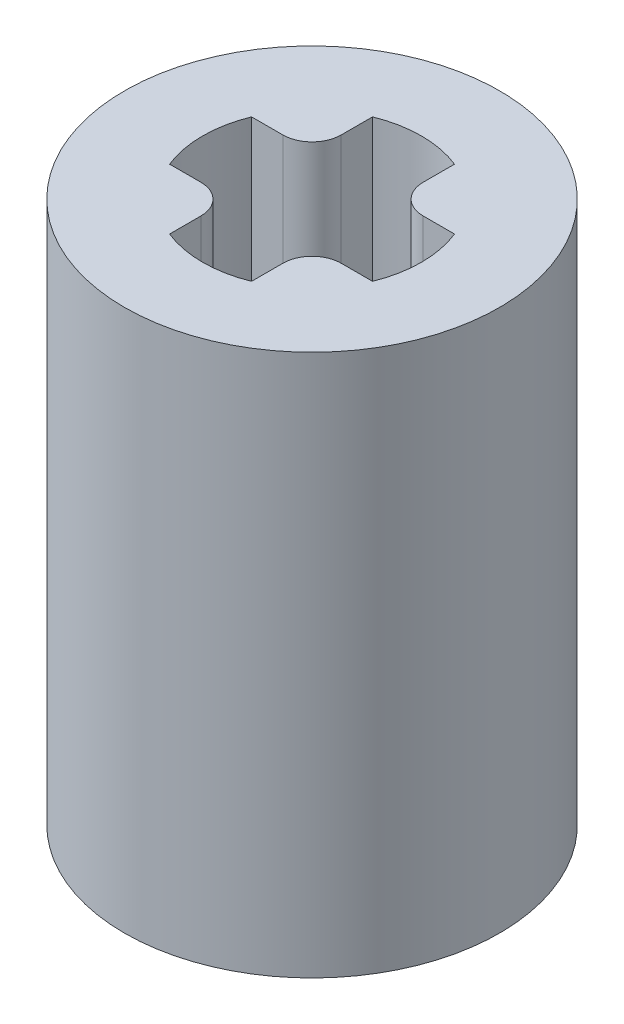
ISO-10303-21;
HEADER;
FILE_DESCRIPTION(('STEP AP214'),'2;1');
FILE_NAME('part.step','',(''),(''),'','','');
FILE_SCHEMA(('AUTOMOTIVE_DESIGN { 1 0 10303 214 1 1 1 1 }'));
ENDSEC;
DATA;
#1=APPLICATION_CONTEXT('core data for automotive mechanical design processes');
#2=APPLICATION_PROTOCOL_DEFINITION('international standard','automotive_design',2000,#1);
#3=PRODUCT_CONTEXT('',#1,'mechanical');
#4=PRODUCT('Part','Part','',(#3));
#5=PRODUCT_RELATED_PRODUCT_CATEGORY('part','',(#4));
#6=PRODUCT_DEFINITION_FORMATION('','',#4);
#7=PRODUCT_DEFINITION_CONTEXT('part definition',#1,'design');
#8=PRODUCT_DEFINITION('design','',#6,#7);
#9=PRODUCT_DEFINITION_SHAPE('','',#8);
#10=(LENGTH_UNIT() NAMED_UNIT(*) SI_UNIT(.MILLI.,.METRE.));
#11=(NAMED_UNIT(*) PLANE_ANGLE_UNIT() SI_UNIT($,.RADIAN.));
#12=(NAMED_UNIT(*) SI_UNIT($,.STERADIAN.) SOLID_ANGLE_UNIT());
#13=UNCERTAINTY_MEASURE_WITH_UNIT(LENGTH_MEASURE(1.E-05),#10,'distance_accuracy_value','');
#14=(GEOMETRIC_REPRESENTATION_CONTEXT(3) GLOBAL_UNCERTAINTY_ASSIGNED_CONTEXT((#13)) GLOBAL_UNIT_ASSIGNED_CONTEXT((#10,
#11,#12)) REPRESENTATION_CONTEXT('',''));
#15=CARTESIAN_POINT('',(0.,0.,0.));
#16=DIRECTION('',(0.,0.,1.));
#17=DIRECTION('',(1.,0.,0.));
#18=AXIS2_PLACEMENT_3D('',#15,#16,#17);
#19=CARTESIAN_POINT('',(0.,6.5,0.));
#20=DIRECTION('',(0.,-1.,0.));
#21=DIRECTION('',(0.,0.,-1.));
#22=AXIS2_PLACEMENT_3D('',#19,#20,#21);
#23=CYLINDRICAL_SURFACE('',#22,4.5);
#24=CARTESIAN_POINT('',(0.,6.5,0.));
#25=DIRECTION('',(0.,1.,0.));
#26=DIRECTION('',(0.,0.,1.));
#27=AXIS2_PLACEMENT_3D('',#24,#25,#26);
#28=CIRCLE('',#27,4.5);
#29=CARTESIAN_POINT('',(0.,6.5,4.5));
#30=VERTEX_POINT('',#29);
#31=EDGE_CURVE('E11',#30,#30,#28,.T.);
#32=ORIENTED_EDGE('',*,*,#31,.F.);
#33=EDGE_LOOP('',(#32));
#34=FACE_BOUND('',#33,.T.);
#35=CARTESIAN_POINT('',(0.,-6.5,0.));
#36=DIRECTION('',(0.,1.,0.));
#37=DIRECTION('',(0.,0.,1.));
#38=AXIS2_PLACEMENT_3D('',#35,#36,#37);
#39=CIRCLE('',#38,4.5);
#40=CARTESIAN_POINT('',(0.,-6.5,4.5));
#41=VERTEX_POINT('',#40);
#42=EDGE_CURVE('E37',#41,#41,#39,.T.);
#43=ORIENTED_EDGE('',*,*,#42,.T.);
#44=EDGE_LOOP('',(#43));
#45=FACE_BOUND('',#44,.T.);
#46=ADVANCED_FACE('F34',(#34,#45),#23,.T.);
#47=CARTESIAN_POINT('',(0.,6.5,0.));
#48=DIRECTION('',(0.,1.,0.));
#49=DIRECTION('',(0.,0.,1.));
#50=AXIS2_PLACEMENT_3D('',#47,#48,#49);
#51=PLANE('',#50);
#52=CARTESIAN_POINT('',(0.,6.5,0.));
#53=DIRECTION('',(0.,1.,0.));
#54=DIRECTION('',(0.,0.,1.));
#55=AXIS2_PLACEMENT_3D('',#52,#53,#54);
#56=CIRCLE('',#55,2.625);
#57=CARTESIAN_POINT('',(0.983,6.5,-2.4339958915331));
#58=VERTEX_POINT('',#57);
#59=CARTESIAN_POINT('',(-0.983,6.5,-2.4339958915331));
#60=VERTEX_POINT('',#59);
#61=EDGE_CURVE('E48',#58,#60,#56,.T.);
#62=ORIENTED_EDGE('',*,*,#61,.F.);
#63=DIRECTION('',(0.,0.,-1.));
#64=VECTOR('',#63,1.);
#65=CARTESIAN_POINT('',(0.983,6.5,-2.4339958915331));
#66=LINE('',#65,#64);
#67=CARTESIAN_POINT('',(0.983000000000003,6.5,-1.683));
#68=VERTEX_POINT('',#67);
#69=EDGE_CURVE('E191',#68,#58,#66,.T.);
#70=ORIENTED_EDGE('',*,*,#69,.F.);
#71=CARTESIAN_POINT('',(1.683,6.5,-1.683));
#72=DIRECTION('',(0.,-1.,0.));
#73=DIRECTION('',(0.,0.,1.));
#74=AXIS2_PLACEMENT_3D('',#71,#72,#73);
#75=CIRCLE('',#74,0.7);
#76=CARTESIAN_POINT('',(1.683,6.5,-0.983));
#77=VERTEX_POINT('',#76);
#78=EDGE_CURVE('E194',#77,#68,#75,.T.);
#79=ORIENTED_EDGE('',*,*,#78,.F.);
#80=DIRECTION('',(-1.,0.,0.));
#81=VECTOR('',#80,1.);
#82=CARTESIAN_POINT('',(1.683,6.5,-0.983));
#83=LINE('',#82,#81);
#84=CARTESIAN_POINT('',(2.4339958915331,6.5,-0.983000000000001));
#85=VERTEX_POINT('',#84);
#86=EDGE_CURVE('E270',#85,#77,#83,.T.);
#87=ORIENTED_EDGE('',*,*,#86,.F.);
#88=CARTESIAN_POINT('',(0.,6.5,0.));
#89=DIRECTION('',(0.,1.,0.));
#90=DIRECTION('',(0.,0.,1.));
#91=AXIS2_PLACEMENT_3D('',#88,#89,#90);
#92=CIRCLE('',#91,2.625);
#93=CARTESIAN_POINT('',(2.4339958915331,6.5,0.983));
#94=VERTEX_POINT('',#93);
#95=EDGE_CURVE('E267',#94,#85,#92,.T.);
#96=ORIENTED_EDGE('',*,*,#95,.F.);
#97=DIRECTION('',(1.,0.,0.));
#98=VECTOR('',#97,1.);
#99=CARTESIAN_POINT('',(1.683,6.5,0.983));
#100=LINE('',#99,#98);
#101=CARTESIAN_POINT('',(1.683,6.5,0.983));
#102=VERTEX_POINT('',#101);
#103=EDGE_CURVE('E264',#102,#94,#100,.T.);
#104=ORIENTED_EDGE('',*,*,#103,.F.);
#105=CARTESIAN_POINT('',(1.683,6.5,1.683));
#106=DIRECTION('',(0.,-1.,0.));
#107=DIRECTION('',(0.,0.,-1.));
#108=AXIS2_PLACEMENT_3D('',#105,#106,#107);
#109=CIRCLE('',#108,0.7);
#110=CARTESIAN_POINT('',(0.983000000000003,6.5,1.683));
#111=VERTEX_POINT('',#110);
#112=EDGE_CURVE('E261',#111,#102,#109,.T.);
#113=ORIENTED_EDGE('',*,*,#112,.F.);
#114=DIRECTION('',(0.,0.,-1.));
#115=VECTOR('',#114,1.);
#116=CARTESIAN_POINT('',(0.983000000000002,6.5,2.4339958915331));
#117=LINE('',#116,#115);
#118=CARTESIAN_POINT('',(0.983000000000002,6.5,2.4339958915331));
#119=VERTEX_POINT('',#118);
#120=EDGE_CURVE('E258',#119,#111,#117,.T.);
#121=ORIENTED_EDGE('',*,*,#120,.F.);
#122=CARTESIAN_POINT('',(0.,6.5,0.));
#123=DIRECTION('',(0.,1.,0.));
#124=DIRECTION('',(0.,0.,1.));
#125=AXIS2_PLACEMENT_3D('',#122,#123,#124);
#126=CIRCLE('',#125,2.625);
#127=CARTESIAN_POINT('',(-0.983000000000001,6.5,2.4339958915331));
#128=VERTEX_POINT('',#127);
#129=EDGE_CURVE('E255',#128,#119,#126,.T.);
#130=ORIENTED_EDGE('',*,*,#129,.F.);
#131=DIRECTION('',(0.,0.,1.));
#132=VECTOR('',#131,1.);
#133=CARTESIAN_POINT('',(-0.983,6.5,2.4339958915331));
#134=LINE('',#133,#132);
#135=CARTESIAN_POINT('',(-0.983000000000002,6.5,1.683));
#136=VERTEX_POINT('',#135);
#137=EDGE_CURVE('E252',#136,#128,#134,.T.);
#138=ORIENTED_EDGE('',*,*,#137,.F.);
#139=CARTESIAN_POINT('',(-1.683,6.5,1.683));
#140=DIRECTION('',(0.,-1.,0.));
#141=DIRECTION('',(0.,0.,1.));
#142=AXIS2_PLACEMENT_3D('',#139,#140,#141);
#143=CIRCLE('',#142,0.7);
#144=CARTESIAN_POINT('',(-1.683,6.5,0.983));
#145=VERTEX_POINT('',#144);
#146=EDGE_CURVE('E249',#145,#136,#143,.T.);
#147=ORIENTED_EDGE('',*,*,#146,.F.);
#148=DIRECTION('',(1.,0.,0.));
#149=VECTOR('',#148,1.);
#150=CARTESIAN_POINT('',(-1.683,6.5,0.983));
#151=LINE('',#150,#149);
#152=CARTESIAN_POINT('',(-2.4339958915331,6.5,0.983000000000001));
#153=VERTEX_POINT('',#152);
#154=EDGE_CURVE('E246',#153,#145,#151,.T.);
#155=ORIENTED_EDGE('',*,*,#154,.F.);
#156=CARTESIAN_POINT('',(0.,6.5,0.));
#157=DIRECTION('',(0.,1.,0.));
#158=DIRECTION('',(0.,0.,1.));
#159=AXIS2_PLACEMENT_3D('',#156,#157,#158);
#160=CIRCLE('',#159,2.625);
#161=CARTESIAN_POINT('',(-2.4339958915331,6.5,-0.983));
#162=VERTEX_POINT('',#161);
#163=EDGE_CURVE('E243',#162,#153,#160,.T.);
#164=ORIENTED_EDGE('',*,*,#163,.F.);
#165=DIRECTION('',(-1.,0.,0.));
#166=VECTOR('',#165,1.);
#167=CARTESIAN_POINT('',(-1.683,6.5,-0.983));
#168=LINE('',#167,#166);
#169=CARTESIAN_POINT('',(-1.683,6.5,-0.983));
#170=VERTEX_POINT('',#169);
#171=EDGE_CURVE('E240',#170,#162,#168,.T.);
#172=ORIENTED_EDGE('',*,*,#171,.F.);
#173=CARTESIAN_POINT('',(-1.683,6.5,-1.683));
#174=DIRECTION('',(0.,-1.,0.));
#175=DIRECTION('',(0.,0.,-1.));
#176=AXIS2_PLACEMENT_3D('',#173,#174,#175);
#177=CIRCLE('',#176,0.7);
#178=CARTESIAN_POINT('',(-0.983000000000002,6.5,-1.683));
#179=VERTEX_POINT('',#178);
#180=EDGE_CURVE('E237',#179,#170,#177,.T.);
#181=ORIENTED_EDGE('',*,*,#180,.F.);
#182=DIRECTION('',(0.,0.,1.));
#183=VECTOR('',#182,1.);
#184=CARTESIAN_POINT('',(-0.983,6.5,-2.4339958915331));
#185=LINE('',#184,#183);
#186=EDGE_CURVE('E235',#60,#179,#185,.T.);
#187=ORIENTED_EDGE('',*,*,#186,.F.);
#188=EDGE_LOOP('',(#62,#70,#79,#87,#96,#104,#113,#121,#130,#138,#147,#155,#164,#172,#181,#187));
#189=FACE_BOUND('',#188,.T.);
#190=ORIENTED_EDGE('',*,*,#31,.T.);
#191=EDGE_LOOP('',(#190));
#192=FACE_BOUND('',#191,.T.);
#193=ADVANCED_FACE('F362',(#189,#192),#51,.T.);
#194=CARTESIAN_POINT('',(0.,-6.5,0.));
#195=DIRECTION('',(0.,1.,0.));
#196=DIRECTION('',(0.,0.,1.));
#197=AXIS2_PLACEMENT_3D('',#194,#195,#196);
#198=PLANE('',#197);
#199=DIRECTION('',(0.,0.,1.));
#200=VECTOR('',#199,1.);
#201=CARTESIAN_POINT('',(1.5865,-6.5,2.11512499630636));
#202=LINE('',#201,#200);
#203=CARTESIAN_POINT('',(1.5865,-6.5,-2.11512499630636));
#204=VERTEX_POINT('',#203);
#205=CARTESIAN_POINT('',(1.5865,-6.5,2.11512499630636));
#206=VERTEX_POINT('',#205);
#207=EDGE_CURVE('E319',#204,#206,#202,.T.);
#208=ORIENTED_EDGE('',*,*,#207,.F.);
#209=CARTESIAN_POINT('',(0.,-6.5,0.));
#210=DIRECTION('',(0.,-1.,0.));
#211=DIRECTION('',(0.,0.,-1.));
#212=AXIS2_PLACEMENT_3D('',#209,#210,#211);
#213=CIRCLE('',#212,2.644);
#214=CARTESIAN_POINT('',(-1.5865,-6.5,-2.11512499630636));
#215=VERTEX_POINT('',#214);
#216=EDGE_CURVE('E56',#215,#204,#213,.T.);
#217=ORIENTED_EDGE('',*,*,#216,.F.);
#218=DIRECTION('',(0.,0.,-1.));
#219=VECTOR('',#218,1.);
#220=CARTESIAN_POINT('',(-1.5865,-6.5,-2.11512499630636));
#221=LINE('',#220,#219);
#222=CARTESIAN_POINT('',(-1.5865,-6.5,2.11512499630636));
#223=VERTEX_POINT('',#222);
#224=EDGE_CURVE('E308',#223,#215,#221,.T.);
#225=ORIENTED_EDGE('',*,*,#224,.F.);
#226=CARTESIAN_POINT('',(0.,-6.5,0.));
#227=DIRECTION('',(0.,-1.,0.));
#228=DIRECTION('',(0.,0.,-1.));
#229=AXIS2_PLACEMENT_3D('',#226,#227,#228);
#230=CIRCLE('',#229,2.644);
#231=EDGE_CURVE('E322',#206,#223,#230,.T.);
#232=ORIENTED_EDGE('',*,*,#231,.F.);
#233=EDGE_LOOP('',(#208,#217,#225,#232));
#234=FACE_BOUND('',#233,.T.);
#235=ORIENTED_EDGE('',*,*,#42,.F.);
#236=EDGE_LOOP('',(#235));
#237=FACE_BOUND('',#236,.T.);
#238=ADVANCED_FACE('F340',(#234,#237),#198,.F.);
#239=CARTESIAN_POINT('',(0.,-0.5,0.));
#240=DIRECTION('',(0.,-1.,0.));
#241=DIRECTION('',(0.,0.,-1.));
#242=AXIS2_PLACEMENT_3D('',#239,#240,#241);
#243=CYLINDRICAL_SURFACE('',#242,2.644);
#244=ORIENTED_EDGE('',*,*,#216,.T.);
#245=DIRECTION('',(0.,-1.,0.));
#246=VECTOR('',#245,1.);
#247=CARTESIAN_POINT('',(1.5865,-0.5,-2.11512499630636));
#248=LINE('',#247,#246);
#249=CARTESIAN_POINT('',(1.5865,-0.5,-2.11512499630636));
#250=VERTEX_POINT('',#249);
#251=EDGE_CURVE('E317',#250,#204,#248,.T.);
#252=ORIENTED_EDGE('',*,*,#251,.F.);
#253=CARTESIAN_POINT('',(0.,-0.5,0.));
#254=DIRECTION('',(0.,-1.,0.));
#255=DIRECTION('',(0.,0.,-1.));
#256=AXIS2_PLACEMENT_3D('',#253,#254,#255);
#257=CIRCLE('',#256,2.644);
#258=CARTESIAN_POINT('',(-1.5865,-0.5,-2.11512499630636));
#259=VERTEX_POINT('',#258);
#260=EDGE_CURVE('E304',#259,#250,#257,.T.);
#261=ORIENTED_EDGE('',*,*,#260,.F.);
#262=DIRECTION('',(0.,-1.,0.));
#263=VECTOR('',#262,1.);
#264=CARTESIAN_POINT('',(-1.5865,-0.5,-2.11512499630636));
#265=LINE('',#264,#263);
#266=EDGE_CURVE('E327',#259,#215,#265,.T.);
#267=ORIENTED_EDGE('',*,*,#266,.T.);
#268=EDGE_LOOP('',(#244,#252,#261,#267));
#269=FACE_BOUND('',#268,.T.);
#270=ADVANCED_FACE('F349',(#269),#243,.F.);
#271=CARTESIAN_POINT('',(-1.5865,-0.5,-2.11512499630636));
#272=DIRECTION('',(-1.,0.,0.));
#273=DIRECTION('',(0.,0.,1.));
#274=AXIS2_PLACEMENT_3D('',#271,#272,#273);
#275=PLANE('',#274);
#276=ORIENTED_EDGE('',*,*,#224,.T.);
#277=ORIENTED_EDGE('',*,*,#266,.F.);
#278=DIRECTION('',(0.,0.,-1.));
#279=VECTOR('',#278,1.);
#280=CARTESIAN_POINT('',(-1.5865,-0.5,-2.11512499630636));
#281=LINE('',#280,#279);
#282=CARTESIAN_POINT('',(-1.5865,-0.5,2.11512499630636));
#283=VERTEX_POINT('',#282);
#284=EDGE_CURVE('E314',#283,#259,#281,.T.);
#285=ORIENTED_EDGE('',*,*,#284,.F.);
#286=DIRECTION('',(0.,-1.,0.));
#287=VECTOR('',#286,1.);
#288=CARTESIAN_POINT('',(-1.5865,-0.5,2.11512499630636));
#289=LINE('',#288,#287);
#290=EDGE_CURVE('E329',#283,#223,#289,.T.);
#291=ORIENTED_EDGE('',*,*,#290,.T.);
#292=EDGE_LOOP('',(#276,#277,#285,#291));
#293=FACE_BOUND('',#292,.T.);
#294=ADVANCED_FACE('F351',(#293),#275,.F.);
#295=CARTESIAN_POINT('',(0.,-0.5,0.));
#296=DIRECTION('',(0.,-1.,0.));
#297=DIRECTION('',(0.,0.,-1.));
#298=AXIS2_PLACEMENT_3D('',#295,#296,#297);
#299=CYLINDRICAL_SURFACE('',#298,2.644);
#300=ORIENTED_EDGE('',*,*,#231,.T.);
#301=ORIENTED_EDGE('',*,*,#290,.F.);
#302=CARTESIAN_POINT('',(0.,-0.5,0.));
#303=DIRECTION('',(0.,-1.,0.));
#304=DIRECTION('',(0.,0.,-1.));
#305=AXIS2_PLACEMENT_3D('',#302,#303,#304);
#306=CIRCLE('',#305,2.644);
#307=CARTESIAN_POINT('',(1.5865,-0.5,2.11512499630636));
#308=VERTEX_POINT('',#307);
#309=EDGE_CURVE('E311',#308,#283,#306,.T.);
#310=ORIENTED_EDGE('',*,*,#309,.F.);
#311=DIRECTION('',(0.,-1.,0.));
#312=VECTOR('',#311,1.);
#313=CARTESIAN_POINT('',(1.5865,-0.5,2.11512499630636));
#314=LINE('',#313,#312);
#315=EDGE_CURVE('E331',#308,#206,#314,.T.);
#316=ORIENTED_EDGE('',*,*,#315,.T.);
#317=EDGE_LOOP('',(#300,#301,#310,#316));
#318=FACE_BOUND('',#317,.T.);
#319=ADVANCED_FACE('F344',(#318),#299,.F.);
#320=CARTESIAN_POINT('',(1.5865,-0.5,2.11512499630636));
#321=DIRECTION('',(1.,0.,0.));
#322=DIRECTION('',(0.,0.,-1.));
#323=AXIS2_PLACEMENT_3D('',#320,#321,#322);
#324=PLANE('',#323);
#325=ORIENTED_EDGE('',*,*,#207,.T.);
#326=ORIENTED_EDGE('',*,*,#315,.F.);
#327=DIRECTION('',(0.,0.,1.));
#328=VECTOR('',#327,1.);
#329=CARTESIAN_POINT('',(1.5865,-0.5,2.11512499630636));
#330=LINE('',#329,#328);
#331=EDGE_CURVE('E307',#250,#308,#330,.T.);
#332=ORIENTED_EDGE('',*,*,#331,.F.);
#333=ORIENTED_EDGE('',*,*,#251,.T.);
#334=EDGE_LOOP('',(#325,#326,#332,#333));
#335=FACE_BOUND('',#334,.T.);
#336=ADVANCED_FACE('F336',(#335),#324,.F.);
#337=CARTESIAN_POINT('',(0.,-0.5,0.));
#338=DIRECTION('',(0.,-1.,0.));
#339=DIRECTION('',(0.,0.,-1.));
#340=AXIS2_PLACEMENT_3D('',#337,#338,#339);
#341=PLANE('',#340);
#342=ORIENTED_EDGE('',*,*,#260,.T.);
#343=ORIENTED_EDGE('',*,*,#331,.T.);
#344=ORIENTED_EDGE('',*,*,#309,.T.);
#345=ORIENTED_EDGE('',*,*,#284,.T.);
#346=EDGE_LOOP('',(#342,#343,#344,#345));
#347=FACE_BOUND('',#346,.T.);
#348=ADVANCED_FACE('F348',(#347),#341,.T.);
#349=CARTESIAN_POINT('',(0.,0.5,0.));
#350=DIRECTION('',(0.,1.,0.));
#351=DIRECTION('',(0.,0.,1.));
#352=AXIS2_PLACEMENT_3D('',#349,#350,#351);
#353=CYLINDRICAL_SURFACE('',#352,2.625);
#354=ORIENTED_EDGE('',*,*,#61,.T.);
#355=DIRECTION('',(0.,1.,0.));
#356=VECTOR('',#355,1.);
#357=CARTESIAN_POINT('',(-0.983,0.5,-2.4339958915331));
#358=LINE('',#357,#356);
#359=CARTESIAN_POINT('',(-0.983,0.5,-2.4339958915331));
#360=VERTEX_POINT('',#359);
#361=EDGE_CURVE('E168',#360,#60,#358,.T.);
#362=ORIENTED_EDGE('',*,*,#361,.F.);
#363=CARTESIAN_POINT('',(0.,0.5,0.));
#364=DIRECTION('',(0.,1.,0.));
#365=DIRECTION('',(0.,0.,1.));
#366=AXIS2_PLACEMENT_3D('',#363,#364,#365);
#367=CIRCLE('',#366,2.625);
#368=CARTESIAN_POINT('',(0.983,0.5,-2.4339958915331));
#369=VERTEX_POINT('',#368);
#370=EDGE_CURVE('E172',#369,#360,#367,.T.);
#371=ORIENTED_EDGE('',*,*,#370,.F.);
#372=DIRECTION('',(0.,1.,0.));
#373=VECTOR('',#372,1.);
#374=CARTESIAN_POINT('',(0.983,0.5,-2.4339958915331));
#375=LINE('',#374,#373);
#376=EDGE_CURVE('E275',#369,#58,#375,.T.);
#377=ORIENTED_EDGE('',*,*,#376,.T.);
#378=EDGE_LOOP('',(#354,#362,#371,#377));
#379=FACE_BOUND('',#378,.T.);
#380=ADVANCED_FACE('F170',(#379),#353,.F.);
#381=CARTESIAN_POINT('',(0.983,0.5,-2.4339958915331));
#382=DIRECTION('',(1.,0.,0.));
#383=DIRECTION('',(0.,0.,-1.));
#384=AXIS2_PLACEMENT_3D('',#381,#382,#383);
#385=PLANE('',#384);
#386=ORIENTED_EDGE('',*,*,#69,.T.);
#387=ORIENTED_EDGE('',*,*,#376,.F.);
#388=DIRECTION('',(0.,0.,-1.));
#389=VECTOR('',#388,1.);
#390=CARTESIAN_POINT('',(0.983,0.5,-2.4339958915331));
#391=LINE('',#390,#389);
#392=CARTESIAN_POINT('',(0.983000000000003,0.5,-1.683));
#393=VERTEX_POINT('',#392);
#394=EDGE_CURVE('E178',#393,#369,#391,.T.);
#395=ORIENTED_EDGE('',*,*,#394,.F.);
#396=DIRECTION('',(0.,1.,0.));
#397=VECTOR('',#396,1.);
#398=CARTESIAN_POINT('',(0.983000000000003,0.5,-1.683));
#399=LINE('',#398,#397);
#400=EDGE_CURVE('E277',#393,#68,#399,.T.);
#401=ORIENTED_EDGE('',*,*,#400,.T.);
#402=EDGE_LOOP('',(#386,#387,#395,#401));
#403=FACE_BOUND('',#402,.T.);
#404=ADVANCED_FACE('F384',(#403),#385,.F.);
#405=CARTESIAN_POINT('',(1.683,0.5,-1.683));
#406=DIRECTION('',(0.,1.,0.));
#407=DIRECTION('',(0.,0.,1.));
#408=AXIS2_PLACEMENT_3D('',#405,#406,#407);
#409=CYLINDRICAL_SURFACE('',#408,0.7);
#410=ORIENTED_EDGE('',*,*,#78,.T.);
#411=ORIENTED_EDGE('',*,*,#400,.F.);
#412=CARTESIAN_POINT('',(1.683,0.5,-1.683));
#413=DIRECTION('',(0.,-1.,0.));
#414=DIRECTION('',(0.,0.,1.));
#415=AXIS2_PLACEMENT_3D('',#412,#413,#414);
#416=CIRCLE('',#415,0.7);
#417=CARTESIAN_POINT('',(1.683,0.5,-0.983));
#418=VERTEX_POINT('',#417);
#419=EDGE_CURVE('E231',#418,#393,#416,.T.);
#420=ORIENTED_EDGE('',*,*,#419,.F.);
#421=DIRECTION('',(0.,1.,0.));
#422=VECTOR('',#421,1.);
#423=CARTESIAN_POINT('',(1.683,0.5,-0.983));
#424=LINE('',#423,#422);
#425=EDGE_CURVE('E279',#418,#77,#424,.T.);
#426=ORIENTED_EDGE('',*,*,#425,.T.);
#427=EDGE_LOOP('',(#410,#411,#420,#426));
#428=FACE_BOUND('',#427,.T.);
#429=ADVANCED_FACE('F436',(#428),#409,.T.);
#430=CARTESIAN_POINT('',(1.683,0.5,-0.983));
#431=DIRECTION('',(0.,0.,-1.));
#432=DIRECTION('',(-1.,0.,0.));
#433=AXIS2_PLACEMENT_3D('',#430,#431,#432);
#434=PLANE('',#433);
#435=ORIENTED_EDGE('',*,*,#86,.T.);
#436=ORIENTED_EDGE('',*,*,#425,.F.);
#437=DIRECTION('',(-1.,0.,0.));
#438=VECTOR('',#437,1.);
#439=CARTESIAN_POINT('',(1.683,0.5,-0.983));
#440=LINE('',#439,#438);
#441=CARTESIAN_POINT('',(2.4339958915331,0.5,-0.983000000000001));
#442=VERTEX_POINT('',#441);
#443=EDGE_CURVE('E228',#442,#418,#440,.T.);
#444=ORIENTED_EDGE('',*,*,#443,.F.);
#445=DIRECTION('',(0.,1.,0.));
#446=VECTOR('',#445,1.);
#447=CARTESIAN_POINT('',(2.4339958915331,0.5,-0.983000000000001));
#448=LINE('',#447,#446);
#449=EDGE_CURVE('E281',#442,#85,#448,.T.);
#450=ORIENTED_EDGE('',*,*,#449,.T.);
#451=EDGE_LOOP('',(#435,#436,#444,#450));
#452=FACE_BOUND('',#451,.T.);
#453=ADVANCED_FACE('F432',(#452),#434,.F.);
#454=CARTESIAN_POINT('',(0.,0.5,0.));
#455=DIRECTION('',(0.,1.,0.));
#456=DIRECTION('',(0.,0.,1.));
#457=AXIS2_PLACEMENT_3D('',#454,#455,#456);
#458=CYLINDRICAL_SURFACE('',#457,2.625);
#459=ORIENTED_EDGE('',*,*,#95,.T.);
#460=ORIENTED_EDGE('',*,*,#449,.F.);
#461=CARTESIAN_POINT('',(0.,0.5,0.));
#462=DIRECTION('',(0.,1.,0.));
#463=DIRECTION('',(0.,0.,1.));
#464=AXIS2_PLACEMENT_3D('',#461,#462,#463);
#465=CIRCLE('',#464,2.625);
#466=CARTESIAN_POINT('',(2.4339958915331,0.5,0.983));
#467=VERTEX_POINT('',#466);
#468=EDGE_CURVE('E225',#467,#442,#465,.T.);
#469=ORIENTED_EDGE('',*,*,#468,.F.);
#470=DIRECTION('',(0.,1.,0.));
#471=VECTOR('',#470,1.);
#472=CARTESIAN_POINT('',(2.4339958915331,0.5,0.983));
#473=LINE('',#472,#471);
#474=EDGE_CURVE('E283',#467,#94,#473,.T.);
#475=ORIENTED_EDGE('',*,*,#474,.T.);
#476=EDGE_LOOP('',(#459,#460,#469,#475));
#477=FACE_BOUND('',#476,.T.);
#478=ADVANCED_FACE('F428',(#477),#458,.F.);
#479=CARTESIAN_POINT('',(1.683,0.5,0.983));
#480=DIRECTION('',(0.,0.,1.));
#481=DIRECTION('',(1.,0.,0.));
#482=AXIS2_PLACEMENT_3D('',#479,#480,#481);
#483=PLANE('',#482);
#484=ORIENTED_EDGE('',*,*,#103,.T.);
#485=ORIENTED_EDGE('',*,*,#474,.F.);
#486=DIRECTION('',(1.,0.,0.));
#487=VECTOR('',#486,1.);
#488=CARTESIAN_POINT('',(1.683,0.5,0.983));
#489=LINE('',#488,#487);
#490=CARTESIAN_POINT('',(1.683,0.5,0.983));
#491=VERTEX_POINT('',#490);
#492=EDGE_CURVE('E222',#491,#467,#489,.T.);
#493=ORIENTED_EDGE('',*,*,#492,.F.);
#494=DIRECTION('',(0.,1.,0.));
#495=VECTOR('',#494,1.);
#496=CARTESIAN_POINT('',(1.683,0.5,0.983));
#497=LINE('',#496,#495);
#498=EDGE_CURVE('E285',#491,#102,#497,.T.);
#499=ORIENTED_EDGE('',*,*,#498,.T.);
#500=EDGE_LOOP('',(#484,#485,#493,#499));
#501=FACE_BOUND('',#500,.T.);
#502=ADVANCED_FACE('F424',(#501),#483,.F.);
#503=CARTESIAN_POINT('',(1.683,0.5,1.683));
#504=DIRECTION('',(0.,1.,0.));
#505=DIRECTION('',(0.,0.,1.));
#506=AXIS2_PLACEMENT_3D('',#503,#504,#505);
#507=CYLINDRICAL_SURFACE('',#506,0.7);
#508=ORIENTED_EDGE('',*,*,#112,.T.);
#509=ORIENTED_EDGE('',*,*,#498,.F.);
#510=CARTESIAN_POINT('',(1.683,0.5,1.683));
#511=DIRECTION('',(0.,-1.,0.));
#512=DIRECTION('',(0.,0.,-1.));
#513=AXIS2_PLACEMENT_3D('',#510,#511,#512);
#514=CIRCLE('',#513,0.7);
#515=CARTESIAN_POINT('',(0.983000000000003,0.5,1.683));
#516=VERTEX_POINT('',#515);
#517=EDGE_CURVE('E219',#516,#491,#514,.T.);
#518=ORIENTED_EDGE('',*,*,#517,.F.);
#519=DIRECTION('',(0.,1.,0.));
#520=VECTOR('',#519,1.);
#521=CARTESIAN_POINT('',(0.983000000000003,0.5,1.683));
#522=LINE('',#521,#520);
#523=EDGE_CURVE('E287',#516,#111,#522,.T.);
#524=ORIENTED_EDGE('',*,*,#523,.T.);
#525=EDGE_LOOP('',(#508,#509,#518,#524));
#526=FACE_BOUND('',#525,.T.);
#527=ADVANCED_FACE('F420',(#526),#507,.T.);
#528=CARTESIAN_POINT('',(0.983000000000002,0.5,2.4339958915331));
#529=DIRECTION('',(1.,0.,0.));
#530=DIRECTION('',(0.,0.,-1.));
#531=AXIS2_PLACEMENT_3D('',#528,#529,#530);
#532=PLANE('',#531);
#533=ORIENTED_EDGE('',*,*,#120,.T.);
#534=ORIENTED_EDGE('',*,*,#523,.F.);
#535=DIRECTION('',(0.,0.,-1.));
#536=VECTOR('',#535,1.);
#537=CARTESIAN_POINT('',(0.983000000000002,0.5,2.4339958915331));
#538=LINE('',#537,#536);
#539=CARTESIAN_POINT('',(0.983000000000002,0.5,2.4339958915331));
#540=VERTEX_POINT('',#539);
#541=EDGE_CURVE('E216',#540,#516,#538,.T.);
#542=ORIENTED_EDGE('',*,*,#541,.F.);
#543=DIRECTION('',(0.,1.,0.));
#544=VECTOR('',#543,1.);
#545=CARTESIAN_POINT('',(0.983000000000002,0.5,2.4339958915331));
#546=LINE('',#545,#544);
#547=EDGE_CURVE('E289',#540,#119,#546,.T.);
#548=ORIENTED_EDGE('',*,*,#547,.T.);
#549=EDGE_LOOP('',(#533,#534,#542,#548));
#550=FACE_BOUND('',#549,.T.);
#551=ADVANCED_FACE('F416',(#550),#532,.F.);
#552=CARTESIAN_POINT('',(0.,0.5,0.));
#553=DIRECTION('',(0.,1.,0.));
#554=DIRECTION('',(0.,0.,1.));
#555=AXIS2_PLACEMENT_3D('',#552,#553,#554);
#556=CYLINDRICAL_SURFACE('',#555,2.625);
#557=ORIENTED_EDGE('',*,*,#129,.T.);
#558=ORIENTED_EDGE('',*,*,#547,.F.);
#559=CARTESIAN_POINT('',(0.,0.5,0.));
#560=DIRECTION('',(0.,1.,0.));
#561=DIRECTION('',(0.,0.,1.));
#562=AXIS2_PLACEMENT_3D('',#559,#560,#561);
#563=CIRCLE('',#562,2.625);
#564=CARTESIAN_POINT('',(-0.983000000000001,0.5,2.4339958915331));
#565=VERTEX_POINT('',#564);
#566=EDGE_CURVE('E213',#565,#540,#563,.T.);
#567=ORIENTED_EDGE('',*,*,#566,.F.);
#568=DIRECTION('',(0.,1.,0.));
#569=VECTOR('',#568,1.);
#570=CARTESIAN_POINT('',(-0.983000000000001,0.5,2.4339958915331));
#571=LINE('',#570,#569);
#572=EDGE_CURVE('E291',#565,#128,#571,.T.);
#573=ORIENTED_EDGE('',*,*,#572,.T.);
#574=EDGE_LOOP('',(#557,#558,#567,#573));
#575=FACE_BOUND('',#574,.T.);
#576=ADVANCED_FACE('F412',(#575),#556,.F.);
#577=CARTESIAN_POINT('',(-0.983,0.5,2.4339958915331));
#578=DIRECTION('',(-1.,0.,0.));
#579=DIRECTION('',(0.,0.,1.));
#580=AXIS2_PLACEMENT_3D('',#577,#578,#579);
#581=PLANE('',#580);
#582=ORIENTED_EDGE('',*,*,#137,.T.);
#583=ORIENTED_EDGE('',*,*,#572,.F.);
#584=DIRECTION('',(0.,0.,1.));
#585=VECTOR('',#584,1.);
#586=CARTESIAN_POINT('',(-0.983,0.5,2.4339958915331));
#587=LINE('',#586,#585);
#588=CARTESIAN_POINT('',(-0.983000000000002,0.5,1.683));
#589=VERTEX_POINT('',#588);
#590=EDGE_CURVE('E210',#589,#565,#587,.T.);
#591=ORIENTED_EDGE('',*,*,#590,.F.);
#592=DIRECTION('',(0.,1.,0.));
#593=VECTOR('',#592,1.);
#594=CARTESIAN_POINT('',(-0.983000000000002,0.5,1.683));
#595=LINE('',#594,#593);
#596=EDGE_CURVE('E293',#589,#136,#595,.T.);
#597=ORIENTED_EDGE('',*,*,#596,.T.);
#598=EDGE_LOOP('',(#582,#583,#591,#597));
#599=FACE_BOUND('',#598,.T.);
#600=ADVANCED_FACE('F408',(#599),#581,.F.);
#601=CARTESIAN_POINT('',(-1.683,0.5,1.683));
#602=DIRECTION('',(0.,1.,0.));
#603=DIRECTION('',(0.,0.,1.));
#604=AXIS2_PLACEMENT_3D('',#601,#602,#603);
#605=CYLINDRICAL_SURFACE('',#604,0.7);
#606=ORIENTED_EDGE('',*,*,#146,.T.);
#607=ORIENTED_EDGE('',*,*,#596,.F.);
#608=CARTESIAN_POINT('',(-1.683,0.5,1.683));
#609=DIRECTION('',(0.,-1.,0.));
#610=DIRECTION('',(0.,0.,1.));
#611=AXIS2_PLACEMENT_3D('',#608,#609,#610);
#612=CIRCLE('',#611,0.7);
#613=CARTESIAN_POINT('',(-1.683,0.5,0.983));
#614=VERTEX_POINT('',#613);
#615=EDGE_CURVE('E207',#614,#589,#612,.T.);
#616=ORIENTED_EDGE('',*,*,#615,.F.);
#617=DIRECTION('',(0.,1.,0.));
#618=VECTOR('',#617,1.);
#619=CARTESIAN_POINT('',(-1.683,0.5,0.983));
#620=LINE('',#619,#618);
#621=EDGE_CURVE('E295',#614,#145,#620,.T.);
#622=ORIENTED_EDGE('',*,*,#621,.T.);
#623=EDGE_LOOP('',(#606,#607,#616,#622));
#624=FACE_BOUND('',#623,.T.);
#625=ADVANCED_FACE('F404',(#624),#605,.T.);
#626=CARTESIAN_POINT('',(-1.683,0.5,0.983));
#627=DIRECTION('',(0.,0.,1.));
#628=DIRECTION('',(1.,0.,0.));
#629=AXIS2_PLACEMENT_3D('',#626,#627,#628);
#630=PLANE('',#629);
#631=ORIENTED_EDGE('',*,*,#154,.T.);
#632=ORIENTED_EDGE('',*,*,#621,.F.);
#633=DIRECTION('',(1.,0.,0.));
#634=VECTOR('',#633,1.);
#635=CARTESIAN_POINT('',(-1.683,0.5,0.983));
#636=LINE('',#635,#634);
#637=CARTESIAN_POINT('',(-2.4339958915331,0.5,0.983000000000001));
#638=VERTEX_POINT('',#637);
#639=EDGE_CURVE('E204',#638,#614,#636,.T.);
#640=ORIENTED_EDGE('',*,*,#639,.F.);
#641=DIRECTION('',(0.,1.,0.));
#642=VECTOR('',#641,1.);
#643=CARTESIAN_POINT('',(-2.4339958915331,0.5,0.983000000000001));
#644=LINE('',#643,#642);
#645=EDGE_CURVE('E297',#638,#153,#644,.T.);
#646=ORIENTED_EDGE('',*,*,#645,.T.);
#647=EDGE_LOOP('',(#631,#632,#640,#646));
#648=FACE_BOUND('',#647,.T.);
#649=ADVANCED_FACE('F400',(#648),#630,.F.);
#650=CARTESIAN_POINT('',(0.,0.5,0.));
#651=DIRECTION('',(0.,1.,0.));
#652=DIRECTION('',(0.,0.,1.));
#653=AXIS2_PLACEMENT_3D('',#650,#651,#652);
#654=CYLINDRICAL_SURFACE('',#653,2.625);
#655=ORIENTED_EDGE('',*,*,#163,.T.);
#656=ORIENTED_EDGE('',*,*,#645,.F.);
#657=CARTESIAN_POINT('',(0.,0.5,0.));
#658=DIRECTION('',(0.,1.,0.));
#659=DIRECTION('',(0.,0.,1.));
#660=AXIS2_PLACEMENT_3D('',#657,#658,#659);
#661=CIRCLE('',#660,2.625);
#662=CARTESIAN_POINT('',(-2.4339958915331,0.5,-0.983));
#663=VERTEX_POINT('',#662);
#664=EDGE_CURVE('E201',#663,#638,#661,.T.);
#665=ORIENTED_EDGE('',*,*,#664,.F.);
#666=DIRECTION('',(0.,1.,0.));
#667=VECTOR('',#666,1.);
#668=CARTESIAN_POINT('',(-2.4339958915331,0.5,-0.983));
#669=LINE('',#668,#667);
#670=EDGE_CURVE('E299',#663,#162,#669,.T.);
#671=ORIENTED_EDGE('',*,*,#670,.T.);
#672=EDGE_LOOP('',(#655,#656,#665,#671));
#673=FACE_BOUND('',#672,.T.);
#674=ADVANCED_FACE('F396',(#673),#654,.F.);
#675=CARTESIAN_POINT('',(-1.683,0.5,-0.983));
#676=DIRECTION('',(0.,0.,-1.));
#677=DIRECTION('',(-1.,0.,0.));
#678=AXIS2_PLACEMENT_3D('',#675,#676,#677);
#679=PLANE('',#678);
#680=ORIENTED_EDGE('',*,*,#171,.T.);
#681=ORIENTED_EDGE('',*,*,#670,.F.);
#682=DIRECTION('',(-1.,0.,0.));
#683=VECTOR('',#682,1.);
#684=CARTESIAN_POINT('',(-1.683,0.5,-0.983));
#685=LINE('',#684,#683);
#686=CARTESIAN_POINT('',(-1.683,0.5,-0.983));
#687=VERTEX_POINT('',#686);
#688=EDGE_CURVE('E198',#687,#663,#685,.T.);
#689=ORIENTED_EDGE('',*,*,#688,.F.);
#690=DIRECTION('',(0.,1.,0.));
#691=VECTOR('',#690,1.);
#692=CARTESIAN_POINT('',(-1.683,0.5,-0.983));
#693=LINE('',#692,#691);
#694=EDGE_CURVE('E301',#687,#170,#693,.T.);
#695=ORIENTED_EDGE('',*,*,#694,.T.);
#696=EDGE_LOOP('',(#680,#681,#689,#695));
#697=FACE_BOUND('',#696,.T.);
#698=ADVANCED_FACE('F392',(#697),#679,.F.);
#699=CARTESIAN_POINT('',(-1.683,0.5,-1.683));
#700=DIRECTION('',(0.,1.,0.));
#701=DIRECTION('',(0.,0.,1.));
#702=AXIS2_PLACEMENT_3D('',#699,#700,#701);
#703=CYLINDRICAL_SURFACE('',#702,0.7);
#704=ORIENTED_EDGE('',*,*,#180,.T.);
#705=ORIENTED_EDGE('',*,*,#694,.F.);
#706=CARTESIAN_POINT('',(-1.683,0.5,-1.683));
#707=DIRECTION('',(0.,-1.,0.));
#708=DIRECTION('',(0.,0.,-1.));
#709=AXIS2_PLACEMENT_3D('',#706,#707,#708);
#710=CIRCLE('',#709,0.7);
#711=CARTESIAN_POINT('',(-0.983000000000002,0.5,-1.683));
#712=VERTEX_POINT('',#711);
#713=EDGE_CURVE('E186',#712,#687,#710,.T.);
#714=ORIENTED_EDGE('',*,*,#713,.F.);
#715=DIRECTION('',(0.,1.,0.));
#716=VECTOR('',#715,1.);
#717=CARTESIAN_POINT('',(-0.983000000000002,0.5,-1.683));
#718=LINE('',#717,#716);
#719=EDGE_CURVE('E177',#712,#179,#718,.T.);
#720=ORIENTED_EDGE('',*,*,#719,.T.);
#721=EDGE_LOOP('',(#704,#705,#714,#720));
#722=FACE_BOUND('',#721,.T.);
#723=ADVANCED_FACE('F389',(#722),#703,.T.);
#724=CARTESIAN_POINT('',(-0.983,0.5,-2.4339958915331));
#725=DIRECTION('',(-1.,0.,0.));
#726=DIRECTION('',(0.,0.,1.));
#727=AXIS2_PLACEMENT_3D('',#724,#725,#726);
#728=PLANE('',#727);
#729=ORIENTED_EDGE('',*,*,#186,.T.);
#730=ORIENTED_EDGE('',*,*,#719,.F.);
#731=DIRECTION('',(0.,0.,1.));
#732=VECTOR('',#731,1.);
#733=CARTESIAN_POINT('',(-0.983,0.5,-2.4339958915331));
#734=LINE('',#733,#732);
#735=EDGE_CURVE('E181',#360,#712,#734,.T.);
#736=ORIENTED_EDGE('',*,*,#735,.F.);
#737=ORIENTED_EDGE('',*,*,#361,.T.);
#738=EDGE_LOOP('',(#729,#730,#736,#737));
#739=FACE_BOUND('',#738,.T.);
#740=ADVANCED_FACE('F182',(#739),#728,.F.);
#741=CARTESIAN_POINT('',(0.,0.5,0.));
#742=DIRECTION('',(0.,1.,0.));
#743=DIRECTION('',(0.,0.,1.));
#744=AXIS2_PLACEMENT_3D('',#741,#742,#743);
#745=PLANE('',#744);
#746=ORIENTED_EDGE('',*,*,#370,.T.);
#747=ORIENTED_EDGE('',*,*,#735,.T.);
#748=ORIENTED_EDGE('',*,*,#713,.T.);
#749=ORIENTED_EDGE('',*,*,#688,.T.);
#750=ORIENTED_EDGE('',*,*,#664,.T.);
#751=ORIENTED_EDGE('',*,*,#639,.T.);
#752=ORIENTED_EDGE('',*,*,#615,.T.);
#753=ORIENTED_EDGE('',*,*,#590,.T.);
#754=ORIENTED_EDGE('',*,*,#566,.T.);
#755=ORIENTED_EDGE('',*,*,#541,.T.);
#756=ORIENTED_EDGE('',*,*,#517,.T.);
#757=ORIENTED_EDGE('',*,*,#492,.T.);
#758=ORIENTED_EDGE('',*,*,#468,.T.);
#759=ORIENTED_EDGE('',*,*,#443,.T.);
#760=ORIENTED_EDGE('',*,*,#419,.T.);
#761=ORIENTED_EDGE('',*,*,#394,.T.);
#762=EDGE_LOOP('',(#746,#747,#748,#749,#750,#751,#752,#753,#754,#755,#756,#757,#758,#759,#760,#761));
#763=FACE_BOUND('',#762,.T.);
#764=ADVANCED_FACE('F188',(#763),#745,.T.);
#765=CLOSED_SHELL('',(#46,#193,#238,#270,#294,#319,#336,#348,#380,#404,#429,#453,#478,#502,#527,
#551,#576,#600,#625,#649,#674,#698,#723,#740,#764));
#766=MANIFOLD_SOLID_BREP('B2',#765);
#767=ADVANCED_BREP_SHAPE_REPRESENTATION('',(#18,#766),#14);
#768=SHAPE_DEFINITION_REPRESENTATION(#9,#767);
ENDSEC;
END-ISO-10303-21;
